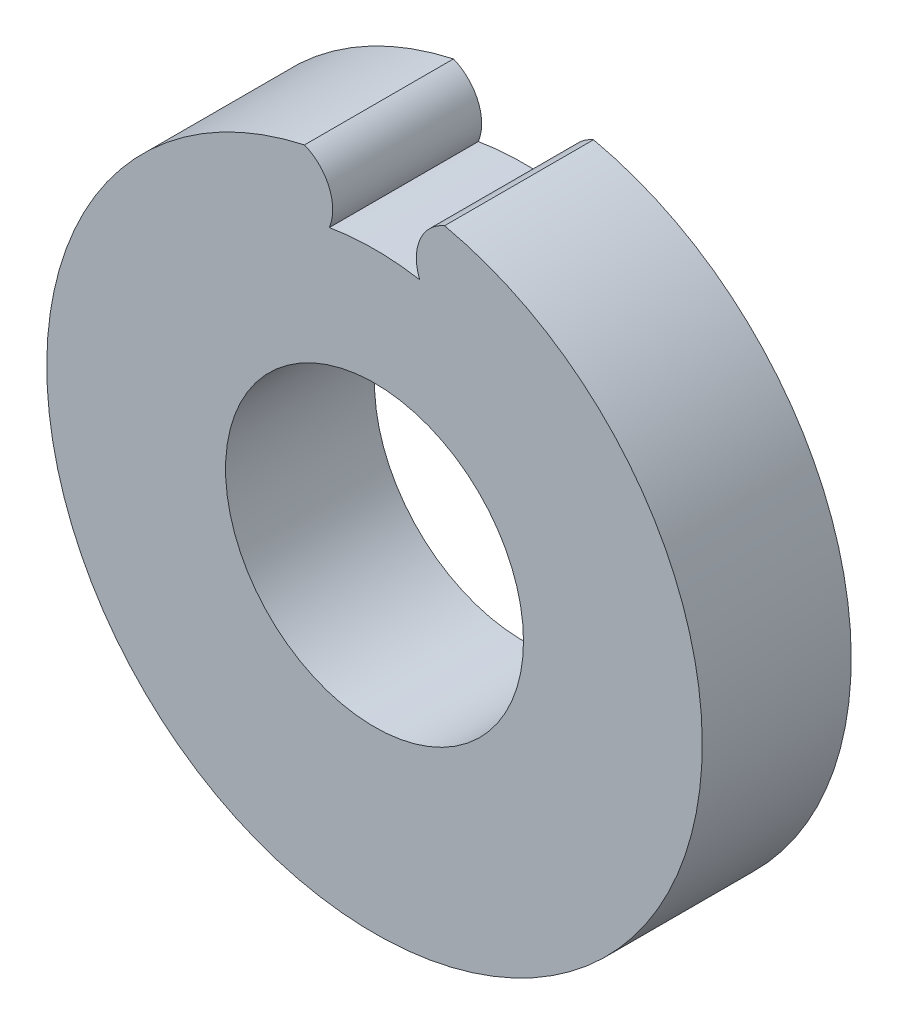
ISO-10303-21;
HEADER;
FILE_DESCRIPTION(('STEP AP214'),'2;1');
FILE_NAME('part.step','',(''),(''),'','','');
FILE_SCHEMA(('AUTOMOTIVE_DESIGN { 1 0 10303 214 1 1 1 1 }'));
ENDSEC;
DATA;
#1=APPLICATION_CONTEXT('core data for automotive mechanical design processes');
#2=APPLICATION_PROTOCOL_DEFINITION('international standard','automotive_design',2000,#1);
#3=PRODUCT_CONTEXT('',#1,'mechanical');
#4=PRODUCT('Part','Part','',(#3));
#5=PRODUCT_RELATED_PRODUCT_CATEGORY('part','',(#4));
#6=PRODUCT_DEFINITION_FORMATION('','',#4);
#7=PRODUCT_DEFINITION_CONTEXT('part definition',#1,'design');
#8=PRODUCT_DEFINITION('design','',#6,#7);
#9=PRODUCT_DEFINITION_SHAPE('','',#8);
#10=(LENGTH_UNIT() NAMED_UNIT(*) SI_UNIT(.MILLI.,.METRE.));
#11=(NAMED_UNIT(*) PLANE_ANGLE_UNIT() SI_UNIT($,.RADIAN.));
#12=(NAMED_UNIT(*) SI_UNIT($,.STERADIAN.) SOLID_ANGLE_UNIT());
#13=UNCERTAINTY_MEASURE_WITH_UNIT(LENGTH_MEASURE(1.E-05),#10,'distance_accuracy_value','');
#14=(GEOMETRIC_REPRESENTATION_CONTEXT(3) GLOBAL_UNCERTAINTY_ASSIGNED_CONTEXT((#13)) GLOBAL_UNIT_ASSIGNED_CONTEXT((#10,
#11,#12)) REPRESENTATION_CONTEXT('',''));
#15=CARTESIAN_POINT('',(0.,0.,0.));
#16=DIRECTION('',(0.,0.,1.));
#17=DIRECTION('',(1.,0.,0.));
#18=AXIS2_PLACEMENT_3D('',#15,#16,#17);
#19=CARTESIAN_POINT('',(0.,0.,6.));
#20=DIRECTION('',(0.,0.,1.));
#21=DIRECTION('',(1.,0.,0.));
#22=AXIS2_PLACEMENT_3D('',#19,#20,#21);
#23=PLANE('',#22);
#24=CARTESIAN_POINT('',(0.,0.,6.));
#25=DIRECTION('',(0.,0.,1.));
#26=DIRECTION('',(1.,0.,0.));
#27=AXIS2_PLACEMENT_3D('',#24,#25,#26);
#28=CIRCLE('',#27,6.);
#29=CARTESIAN_POINT('',(6.,0.,6.));
#30=VERTEX_POINT('',#29);
#31=EDGE_CURVE('E110',#30,#30,#28,.T.);
#32=ORIENTED_EDGE('',*,*,#31,.F.);
#33=EDGE_LOOP('',(#32));
#34=FACE_BOUND('',#33,.T.);
#35=CARTESIAN_POINT('',(-3.51149491481481,11.2036437434838,6.));
#36=DIRECTION('',(0.,0.,-1.));
#37=DIRECTION('',(-1.,0.,0.));
#38=AXIS2_PLACEMENT_3D('',#35,#36,#37);
#39=CIRCLE('',#38,1.82757479266053);
#40=CARTESIAN_POINT('',(-2.81985117133101,12.8952874869676,6.));
#41=VERTEX_POINT('',#40);
#42=CARTESIAN_POINT('',(-1.81985117133101,10.512,6.));
#43=VERTEX_POINT('',#42);
#44=EDGE_CURVE('E102',#41,#43,#39,.T.);
#45=ORIENTED_EDGE('',*,*,#44,.F.);
#46=CARTESIAN_POINT('',(0.,0.,6.));
#47=DIRECTION('',(0.,0.,1.));
#48=DIRECTION('',(1.,0.,0.));
#49=AXIS2_PLACEMENT_3D('',#46,#47,#48);
#50=CIRCLE('',#49,13.2);
#51=CARTESIAN_POINT('',(2.81985117133101,12.8952874869676,6.));
#52=VERTEX_POINT('',#51);
#53=EDGE_CURVE('E11',#41,#52,#50,.T.);
#54=ORIENTED_EDGE('',*,*,#53,.T.);
#55=CARTESIAN_POINT('',(3.51149491481482,11.2036437434838,6.));
#56=DIRECTION('',(0.,0.,1.));
#57=DIRECTION('',(1.,0.,0.));
#58=AXIS2_PLACEMENT_3D('',#55,#56,#57);
#59=CIRCLE('',#58,1.82757479266053);
#60=CARTESIAN_POINT('',(1.81985117133101,10.512,6.));
#61=VERTEX_POINT('',#60);
#62=EDGE_CURVE('E52',#52,#61,#59,.T.);
#63=ORIENTED_EDGE('',*,*,#62,.T.);
#64=CARTESIAN_POINT('',(0.,0.,6.));
#65=DIRECTION('',(0.,0.,-1.));
#66=DIRECTION('',(-1.,0.,0.));
#67=AXIS2_PLACEMENT_3D('',#64,#65,#66);
#68=CIRCLE('',#67,10.6683645553475);
#69=EDGE_CURVE('E96',#43,#61,#68,.T.);
#70=ORIENTED_EDGE('',*,*,#69,.F.);
#71=EDGE_LOOP('',(#45,#54,#63,#70));
#72=FACE_BOUND('',#71,.T.);
#73=ADVANCED_FACE('F37',(#34,#72),#23,.T.);
#74=CARTESIAN_POINT('',(0.,0.,0.));
#75=DIRECTION('',(0.,0.,1.));
#76=DIRECTION('',(1.,0.,0.));
#77=AXIS2_PLACEMENT_3D('',#74,#75,#76);
#78=PLANE('',#77);
#79=CARTESIAN_POINT('',(0.,0.,0.));
#80=DIRECTION('',(0.,0.,1.));
#81=DIRECTION('',(1.,0.,0.));
#82=AXIS2_PLACEMENT_3D('',#79,#80,#81);
#83=CIRCLE('',#82,6.);
#84=CARTESIAN_POINT('',(6.,0.,0.));
#85=VERTEX_POINT('',#84);
#86=EDGE_CURVE('E107',#85,#85,#83,.T.);
#87=ORIENTED_EDGE('',*,*,#86,.T.);
#88=EDGE_LOOP('',(#87));
#89=FACE_BOUND('',#88,.T.);
#90=CARTESIAN_POINT('',(0.,0.,0.));
#91=DIRECTION('',(0.,0.,1.));
#92=DIRECTION('',(1.,0.,0.));
#93=AXIS2_PLACEMENT_3D('',#90,#91,#92);
#94=CIRCLE('',#93,13.2);
#95=CARTESIAN_POINT('',(-2.81985117133101,12.8952874869676,0.));
#96=VERTEX_POINT('',#95);
#97=CARTESIAN_POINT('',(2.81985117133101,12.8952874869676,0.));
#98=VERTEX_POINT('',#97);
#99=EDGE_CURVE('E41',#96,#98,#94,.T.);
#100=ORIENTED_EDGE('',*,*,#99,.F.);
#101=CARTESIAN_POINT('',(-3.51149491481481,11.2036437434838,0.));
#102=DIRECTION('',(0.,0.,-1.));
#103=DIRECTION('',(-1.,0.,0.));
#104=AXIS2_PLACEMENT_3D('',#101,#102,#103);
#105=CIRCLE('',#104,1.82757479266053);
#106=CARTESIAN_POINT('',(-1.81985117133101,10.512,0.));
#107=VERTEX_POINT('',#106);
#108=EDGE_CURVE('E61',#96,#107,#105,.T.);
#109=ORIENTED_EDGE('',*,*,#108,.T.);
#110=CARTESIAN_POINT('',(0.,0.,0.));
#111=DIRECTION('',(0.,0.,-1.));
#112=DIRECTION('',(-1.,0.,0.));
#113=AXIS2_PLACEMENT_3D('',#110,#111,#112);
#114=CIRCLE('',#113,10.6683645553475);
#115=CARTESIAN_POINT('',(1.81985117133101,10.512,0.));
#116=VERTEX_POINT('',#115);
#117=EDGE_CURVE('E91',#107,#116,#114,.T.);
#118=ORIENTED_EDGE('',*,*,#117,.T.);
#119=CARTESIAN_POINT('',(3.51149491481482,11.2036437434838,0.));
#120=DIRECTION('',(0.,0.,1.));
#121=DIRECTION('',(1.,0.,0.));
#122=AXIS2_PLACEMENT_3D('',#119,#120,#121);
#123=CIRCLE('',#122,1.82757479266053);
#124=EDGE_CURVE('E81',#98,#116,#123,.T.);
#125=ORIENTED_EDGE('',*,*,#124,.F.);
#126=EDGE_LOOP('',(#100,#109,#118,#125));
#127=FACE_BOUND('',#126,.T.);
#128=ADVANCED_FACE('F98',(#89,#127),#78,.F.);
#129=CARTESIAN_POINT('',(0.,0.,6.));
#130=DIRECTION('',(0.,0.,-1.));
#131=DIRECTION('',(-1.,0.,0.));
#132=AXIS2_PLACEMENT_3D('',#129,#130,#131);
#133=CYLINDRICAL_SURFACE('',#132,13.2);
#134=ORIENTED_EDGE('',*,*,#53,.F.);
#135=DIRECTION('',(0.,0.,1.));
#136=VECTOR('',#135,1.);
#137=CARTESIAN_POINT('',(-2.81985117133101,12.8952874869676,0.));
#138=LINE('',#137,#136);
#139=EDGE_CURVE('E74',#96,#41,#138,.T.);
#140=ORIENTED_EDGE('',*,*,#139,.F.);
#141=ORIENTED_EDGE('',*,*,#99,.T.);
#142=DIRECTION('',(0.,0.,1.));
#143=VECTOR('',#142,1.);
#144=CARTESIAN_POINT('',(2.81985117133101,12.8952874869676,0.));
#145=LINE('',#144,#143);
#146=EDGE_CURVE('E86',#98,#52,#145,.T.);
#147=ORIENTED_EDGE('',*,*,#146,.T.);
#148=EDGE_LOOP('',(#134,#140,#141,#147));
#149=FACE_BOUND('',#148,.T.);
#150=ADVANCED_FACE('F39',(#149),#133,.T.);
#151=CARTESIAN_POINT('',(0.,0.,6.));
#152=DIRECTION('',(0.,0.,-1.));
#153=DIRECTION('',(-1.,0.,0.));
#154=AXIS2_PLACEMENT_3D('',#151,#152,#153);
#155=CYLINDRICAL_SURFACE('',#154,6.);
#156=ORIENTED_EDGE('',*,*,#31,.T.);
#157=EDGE_LOOP('',(#156));
#158=FACE_BOUND('',#157,.T.);
#159=ORIENTED_EDGE('',*,*,#86,.F.);
#160=EDGE_LOOP('',(#159));
#161=FACE_BOUND('',#160,.T.);
#162=ADVANCED_FACE('F117',(#158,#161),#155,.F.);
#163=CARTESIAN_POINT('',(-3.51149491481481,11.2036437434838,0.));
#164=DIRECTION('',(0.,0.,1.));
#165=DIRECTION('',(1.,0.,0.));
#166=AXIS2_PLACEMENT_3D('',#163,#164,#165);
#167=CYLINDRICAL_SURFACE('',#166,1.82757479266053);
#168=ORIENTED_EDGE('',*,*,#44,.T.);
#169=DIRECTION('',(0.,0.,1.));
#170=VECTOR('',#169,1.);
#171=CARTESIAN_POINT('',(-1.81985117133101,10.512,0.));
#172=LINE('',#171,#170);
#173=EDGE_CURVE('E77',#107,#43,#172,.T.);
#174=ORIENTED_EDGE('',*,*,#173,.F.);
#175=ORIENTED_EDGE('',*,*,#108,.F.);
#176=ORIENTED_EDGE('',*,*,#139,.T.);
#177=EDGE_LOOP('',(#168,#174,#175,#176));
#178=FACE_BOUND('',#177,.T.);
#179=ADVANCED_FACE('F119',(#178),#167,.T.);
#180=CARTESIAN_POINT('',(3.51149491481482,11.2036437434838,0.));
#181=DIRECTION('',(0.,0.,1.));
#182=DIRECTION('',(1.,0.,0.));
#183=AXIS2_PLACEMENT_3D('',#180,#181,#182);
#184=CYLINDRICAL_SURFACE('',#183,1.82757479266053);
#185=ORIENTED_EDGE('',*,*,#62,.F.);
#186=ORIENTED_EDGE('',*,*,#146,.F.);
#187=ORIENTED_EDGE('',*,*,#124,.T.);
#188=DIRECTION('',(0.,0.,1.));
#189=VECTOR('',#188,1.);
#190=CARTESIAN_POINT('',(1.81985117133101,10.512,0.));
#191=LINE('',#190,#189);
#192=EDGE_CURVE('E84',#116,#61,#191,.T.);
#193=ORIENTED_EDGE('',*,*,#192,.T.);
#194=EDGE_LOOP('',(#185,#186,#187,#193));
#195=FACE_BOUND('',#194,.T.);
#196=ADVANCED_FACE('F83',(#195),#184,.T.);
#197=CARTESIAN_POINT('',(0.,0.,0.));
#198=DIRECTION('',(0.,0.,1.));
#199=DIRECTION('',(1.,0.,0.));
#200=AXIS2_PLACEMENT_3D('',#197,#198,#199);
#201=CYLINDRICAL_SURFACE('',#200,10.6683645553475);
#202=ORIENTED_EDGE('',*,*,#69,.T.);
#203=ORIENTED_EDGE('',*,*,#192,.F.);
#204=ORIENTED_EDGE('',*,*,#117,.F.);
#205=ORIENTED_EDGE('',*,*,#173,.T.);
#206=EDGE_LOOP('',(#202,#203,#204,#205));
#207=FACE_BOUND('',#206,.T.);
#208=ADVANCED_FACE('F94',(#207),#201,.T.);
#209=CLOSED_SHELL('',(#73,#128,#150,#162,#179,#196,#208));
#210=MANIFOLD_SOLID_BREP('B2',#209);
#211=ADVANCED_BREP_SHAPE_REPRESENTATION('',(#18,#210),#14);
#212=SHAPE_DEFINITION_REPRESENTATION(#9,#211);
ENDSEC;
END-ISO-10303-21;
